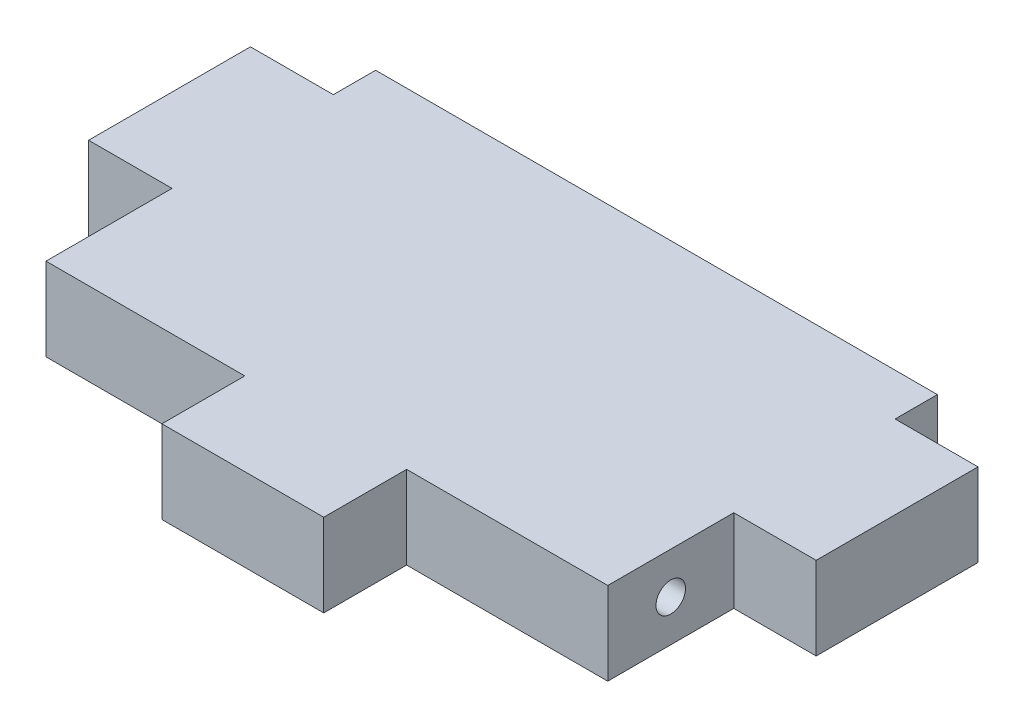
ISO-10303-21;
HEADER;
FILE_DESCRIPTION(('STEP AP214'),'2;1');
FILE_NAME('part.step','',(''),(''),'','','');
FILE_SCHEMA(('AUTOMOTIVE_DESIGN { 1 0 10303 214 1 1 1 1 }'));
ENDSEC;
DATA;
#1=APPLICATION_CONTEXT('core data for automotive mechanical design processes');
#2=APPLICATION_PROTOCOL_DEFINITION('international standard','automotive_design',2000,#1);
#3=PRODUCT_CONTEXT('',#1,'mechanical');
#4=PRODUCT('Part','Part','',(#3));
#5=PRODUCT_RELATED_PRODUCT_CATEGORY('part','',(#4));
#6=PRODUCT_DEFINITION_FORMATION('','',#4);
#7=PRODUCT_DEFINITION_CONTEXT('part definition',#1,'design');
#8=PRODUCT_DEFINITION('design','',#6,#7);
#9=PRODUCT_DEFINITION_SHAPE('','',#8);
#10=(LENGTH_UNIT() NAMED_UNIT(*) SI_UNIT(.MILLI.,.METRE.));
#11=(NAMED_UNIT(*) PLANE_ANGLE_UNIT() SI_UNIT($,.RADIAN.));
#12=(NAMED_UNIT(*) SI_UNIT($,.STERADIAN.) SOLID_ANGLE_UNIT());
#13=UNCERTAINTY_MEASURE_WITH_UNIT(LENGTH_MEASURE(1.E-05),#10,'distance_accuracy_value','');
#14=(GEOMETRIC_REPRESENTATION_CONTEXT(3) GLOBAL_UNCERTAINTY_ASSIGNED_CONTEXT((#13)) GLOBAL_UNIT_ASSIGNED_CONTEXT((#10,
#11,#12)) REPRESENTATION_CONTEXT('',''));
#15=CARTESIAN_POINT('',(0.,0.,0.));
#16=DIRECTION('',(0.,0.,1.));
#17=DIRECTION('',(1.,0.,0.));
#18=AXIS2_PLACEMENT_3D('',#15,#16,#17);
#19=CARTESIAN_POINT('',(-21.4249,6.35,15.912165879998));
#20=DIRECTION('',(1.,0.,0.));
#21=DIRECTION('',(0.,0.,-1.));
#22=AXIS2_PLACEMENT_3D('',#19,#20,#21);
#23=PLANE('',#22);
#24=DIRECTION('',(0.,0.,1.));
#25=VECTOR('',#24,1.);
#26=CARTESIAN_POINT('',(-21.4249,0.,15.912165879998));
#27=LINE('',#26,#25);
#28=CARTESIAN_POINT('',(-21.4249,0.,6.26016587999947));
#29=VERTEX_POINT('',#28);
#30=CARTESIAN_POINT('',(-21.4249,0.,15.912165879998));
#31=VERTEX_POINT('',#30);
#32=EDGE_CURVE('E178',#29,#31,#27,.T.);
#33=ORIENTED_EDGE('',*,*,#32,.T.);
#34=DIRECTION('',(0.,-1.,0.));
#35=VECTOR('',#34,1.);
#36=CARTESIAN_POINT('',(-21.4249,6.35,15.912165879998));
#37=LINE('',#36,#35);
#38=CARTESIAN_POINT('',(-21.4249,6.35,15.912165879998));
#39=VERTEX_POINT('',#38);
#40=EDGE_CURVE('E11',#39,#31,#37,.T.);
#41=ORIENTED_EDGE('',*,*,#40,.F.);
#42=DIRECTION('',(0.,0.,1.));
#43=VECTOR('',#42,1.);
#44=CARTESIAN_POINT('',(-21.4249,6.35,15.912165879998));
#45=LINE('',#44,#43);
#46=CARTESIAN_POINT('',(-21.4249,6.35,6.26016587999947));
#47=VERTEX_POINT('',#46);
#48=EDGE_CURVE('E209',#47,#39,#45,.T.);
#49=ORIENTED_EDGE('',*,*,#48,.F.);
#50=DIRECTION('',(0.,-1.,0.));
#51=VECTOR('',#50,1.);
#52=CARTESIAN_POINT('',(-21.4249,6.35,6.26016587999947));
#53=LINE('',#52,#51);
#54=EDGE_CURVE('E174',#47,#29,#53,.T.);
#55=ORIENTED_EDGE('',*,*,#54,.T.);
#56=EDGE_LOOP('',(#33,#41,#49,#55));
#57=FACE_BOUND('',#56,.T.);
#58=CARTESIAN_POINT('',(-21.4249,3.175,11.0861658799995));
#59=DIRECTION('',(1.,0.,0.));
#60=DIRECTION('',(0.,0.,-1.));
#61=AXIS2_PLACEMENT_3D('',#58,#59,#60);
#62=CIRCLE('',#61,1.1303);
#63=CARTESIAN_POINT('',(-21.4249,3.175,9.95586587999948));
#64=VERTEX_POINT('',#63);
#65=EDGE_CURVE('E36',#64,#64,#62,.F.);
#66=ORIENTED_EDGE('',*,*,#65,.F.);
#67=EDGE_LOOP('',(#66));
#68=FACE_BOUND('',#67,.T.);
#69=ADVANCED_FACE('F33',(#57,#68),#23,.F.);
#70=CARTESIAN_POINT('',(-21.4249,6.35,15.912165879998));
#71=DIRECTION('',(0.,0.,-1.));
#72=DIRECTION('',(-1.,0.,0.));
#73=AXIS2_PLACEMENT_3D('',#70,#71,#72);
#74=PLANE('',#73);
#75=DIRECTION('',(1.,0.,0.));
#76=VECTOR('',#75,1.);
#77=CARTESIAN_POINT('',(-21.4249,0.,15.912165879998));
#78=LINE('',#77,#76);
#79=CARTESIAN_POINT('',(-6.1976,0.,15.912165879998));
#80=VERTEX_POINT('',#79);
#81=EDGE_CURVE('E181',#31,#80,#78,.T.);
#82=ORIENTED_EDGE('',*,*,#81,.T.);
#83=DIRECTION('',(0.,-1.,0.));
#84=VECTOR('',#83,1.);
#85=CARTESIAN_POINT('',(-6.1976,6.35,15.912165879998));
#86=LINE('',#85,#84);
#87=CARTESIAN_POINT('',(-6.1976,6.35,15.912165879998));
#88=VERTEX_POINT('',#87);
#89=EDGE_CURVE('E42',#88,#80,#86,.T.);
#90=ORIENTED_EDGE('',*,*,#89,.F.);
#91=DIRECTION('',(1.,0.,0.));
#92=VECTOR('',#91,1.);
#93=CARTESIAN_POINT('',(-21.4249,6.35,15.912165879998));
#94=LINE('',#93,#92);
#95=EDGE_CURVE('E117',#39,#88,#94,.T.);
#96=ORIENTED_EDGE('',*,*,#95,.F.);
#97=ORIENTED_EDGE('',*,*,#40,.T.);
#98=EDGE_LOOP('',(#82,#90,#96,#97));
#99=FACE_BOUND('',#98,.T.);
#100=ADVANCED_FACE('F309',(#99),#74,.F.);
#101=CARTESIAN_POINT('',(-6.1976,6.35,22.262165879998));
#102=DIRECTION('',(1.,0.,0.));
#103=DIRECTION('',(0.,0.,-1.));
#104=AXIS2_PLACEMENT_3D('',#101,#102,#103);
#105=PLANE('',#104);
#106=DIRECTION('',(0.,0.,1.));
#107=VECTOR('',#106,1.);
#108=CARTESIAN_POINT('',(-6.1976,0.,22.262165879998));
#109=LINE('',#108,#107);
#110=CARTESIAN_POINT('',(-6.1976,0.,22.262165879998));
#111=VERTEX_POINT('',#110);
#112=EDGE_CURVE('E184',#80,#111,#109,.T.);
#113=ORIENTED_EDGE('',*,*,#112,.T.);
#114=DIRECTION('',(0.,-1.,0.));
#115=VECTOR('',#114,1.);
#116=CARTESIAN_POINT('',(-6.1976,6.35,22.262165879998));
#117=LINE('',#116,#115);
#118=CARTESIAN_POINT('',(-6.1976,6.35,22.262165879998));
#119=VERTEX_POINT('',#118);
#120=EDGE_CURVE('E240',#119,#111,#117,.T.);
#121=ORIENTED_EDGE('',*,*,#120,.F.);
#122=DIRECTION('',(0.,0.,1.));
#123=VECTOR('',#122,1.);
#124=CARTESIAN_POINT('',(-6.1976,6.35,22.262165879998));
#125=LINE('',#124,#123);
#126=EDGE_CURVE('E249',#88,#119,#125,.T.);
#127=ORIENTED_EDGE('',*,*,#126,.F.);
#128=ORIENTED_EDGE('',*,*,#89,.T.);
#129=EDGE_LOOP('',(#113,#121,#127,#128));
#130=FACE_BOUND('',#129,.T.);
#131=ADVANCED_FACE('F247',(#130),#105,.F.);
#132=CARTESIAN_POINT('',(6.1976,6.35,22.262165879998));
#133=DIRECTION('',(0.,0.,-1.));
#134=DIRECTION('',(-1.,0.,0.));
#135=AXIS2_PLACEMENT_3D('',#132,#133,#134);
#136=PLANE('',#135);
#137=DIRECTION('',(1.,0.,0.));
#138=VECTOR('',#137,1.);
#139=CARTESIAN_POINT('',(6.1976,0.,22.262165879998));
#140=LINE('',#139,#138);
#141=CARTESIAN_POINT('',(6.1976,0.,22.262165879998));
#142=VERTEX_POINT('',#141);
#143=EDGE_CURVE('E186',#111,#142,#140,.T.);
#144=ORIENTED_EDGE('',*,*,#143,.T.);
#145=DIRECTION('',(0.,-1.,0.));
#146=VECTOR('',#145,1.);
#147=CARTESIAN_POINT('',(6.1976,6.35,22.262165879998));
#148=LINE('',#147,#146);
#149=CARTESIAN_POINT('',(6.1976,6.35,22.262165879998));
#150=VERTEX_POINT('',#149);
#151=EDGE_CURVE('E237',#150,#142,#148,.T.);
#152=ORIENTED_EDGE('',*,*,#151,.F.);
#153=DIRECTION('',(1.,0.,0.));
#154=VECTOR('',#153,1.);
#155=CARTESIAN_POINT('',(6.1976,6.35,22.262165879998));
#156=LINE('',#155,#154);
#157=EDGE_CURVE('E267',#119,#150,#156,.T.);
#158=ORIENTED_EDGE('',*,*,#157,.F.);
#159=ORIENTED_EDGE('',*,*,#120,.T.);
#160=EDGE_LOOP('',(#144,#152,#158,#159));
#161=FACE_BOUND('',#160,.T.);
#162=ADVANCED_FACE('F258',(#161),#136,.F.);
#163=CARTESIAN_POINT('',(6.1976,6.35,15.912165879998));
#164=DIRECTION('',(-1.,0.,0.));
#165=DIRECTION('',(0.,0.,1.));
#166=AXIS2_PLACEMENT_3D('',#163,#164,#165);
#167=PLANE('',#166);
#168=DIRECTION('',(0.,0.,-1.));
#169=VECTOR('',#168,1.);
#170=CARTESIAN_POINT('',(6.1976,0.,15.912165879998));
#171=LINE('',#170,#169);
#172=CARTESIAN_POINT('',(6.1976,0.,15.912165879998));
#173=VERTEX_POINT('',#172);
#174=EDGE_CURVE('E188',#142,#173,#171,.T.);
#175=ORIENTED_EDGE('',*,*,#174,.T.);
#176=DIRECTION('',(0.,-1.,0.));
#177=VECTOR('',#176,1.);
#178=CARTESIAN_POINT('',(6.1976,6.35,15.912165879998));
#179=LINE('',#178,#177);
#180=CARTESIAN_POINT('',(6.1976,6.35,15.912165879998));
#181=VERTEX_POINT('',#180);
#182=EDGE_CURVE('E234',#181,#173,#179,.T.);
#183=ORIENTED_EDGE('',*,*,#182,.F.);
#184=DIRECTION('',(0.,0.,-1.));
#185=VECTOR('',#184,1.);
#186=CARTESIAN_POINT('',(6.1976,6.35,15.912165879998));
#187=LINE('',#186,#185);
#188=EDGE_CURVE('E264',#150,#181,#187,.T.);
#189=ORIENTED_EDGE('',*,*,#188,.F.);
#190=ORIENTED_EDGE('',*,*,#151,.T.);
#191=EDGE_LOOP('',(#175,#183,#189,#190));
#192=FACE_BOUND('',#191,.T.);
#193=ADVANCED_FACE('F262',(#192),#167,.F.);
#194=CARTESIAN_POINT('',(6.1976,6.35,15.912165879998));
#195=DIRECTION('',(0.,0.,-1.));
#196=DIRECTION('',(-1.,0.,0.));
#197=AXIS2_PLACEMENT_3D('',#194,#195,#196);
#198=PLANE('',#197);
#199=DIRECTION('',(1.,0.,0.));
#200=VECTOR('',#199,1.);
#201=CARTESIAN_POINT('',(6.1976,0.,15.912165879998));
#202=LINE('',#201,#200);
#203=CARTESIAN_POINT('',(21.6027000000022,0.,15.912165879998));
#204=VERTEX_POINT('',#203);
#205=EDGE_CURVE('E190',#173,#204,#202,.T.);
#206=ORIENTED_EDGE('',*,*,#205,.T.);
#207=DIRECTION('',(0.,-1.,0.));
#208=VECTOR('',#207,1.);
#209=CARTESIAN_POINT('',(21.6027000000022,6.35,15.912165879998));
#210=LINE('',#209,#208);
#211=CARTESIAN_POINT('',(21.6027000000022,6.35,15.912165879998));
#212=VERTEX_POINT('',#211);
#213=EDGE_CURVE('E231',#212,#204,#210,.T.);
#214=ORIENTED_EDGE('',*,*,#213,.F.);
#215=DIRECTION('',(1.,0.,0.));
#216=VECTOR('',#215,1.);
#217=CARTESIAN_POINT('',(6.1976,6.35,15.912165879998));
#218=LINE('',#217,#216);
#219=EDGE_CURVE('E266',#181,#212,#218,.T.);
#220=ORIENTED_EDGE('',*,*,#219,.F.);
#221=ORIENTED_EDGE('',*,*,#182,.T.);
#222=EDGE_LOOP('',(#206,#214,#220,#221));
#223=FACE_BOUND('',#222,.T.);
#224=ADVANCED_FACE('F322',(#223),#198,.F.);
#225=CARTESIAN_POINT('',(21.6027000000022,6.35,6.26016587999947));
#226=DIRECTION('',(-1.,0.,0.));
#227=DIRECTION('',(0.,0.,1.));
#228=AXIS2_PLACEMENT_3D('',#225,#226,#227);
#229=PLANE('',#228);
#230=CARTESIAN_POINT('',(21.6027000000022,3.175,11.0861658799995));
#231=DIRECTION('',(1.,0.,0.));
#232=DIRECTION('',(0.,0.,-1.));
#233=AXIS2_PLACEMENT_3D('',#230,#231,#232);
#234=CIRCLE('',#233,1.1303);
#235=CARTESIAN_POINT('',(21.6027000000022,3.175,9.95586587999948));
#236=VERTEX_POINT('',#235);
#237=EDGE_CURVE('E437',#236,#236,#234,.T.);
#238=ORIENTED_EDGE('',*,*,#237,.F.);
#239=EDGE_LOOP('',(#238));
#240=FACE_BOUND('',#239,.T.);
#241=DIRECTION('',(0.,0.,-1.));
#242=VECTOR('',#241,1.);
#243=CARTESIAN_POINT('',(21.6027000000022,0.,6.26016587999947));
#244=LINE('',#243,#242);
#245=CARTESIAN_POINT('',(21.6027000000022,0.,6.26016587999947));
#246=VERTEX_POINT('',#245);
#247=EDGE_CURVE('E192',#204,#246,#244,.T.);
#248=ORIENTED_EDGE('',*,*,#247,.T.);
#249=DIRECTION('',(0.,-1.,0.));
#250=VECTOR('',#249,1.);
#251=CARTESIAN_POINT('',(21.6027000000022,6.35,6.26016587999947));
#252=LINE('',#251,#250);
#253=CARTESIAN_POINT('',(21.6027000000022,6.35,6.26016587999947));
#254=VERTEX_POINT('',#253);
#255=EDGE_CURVE('E228',#254,#246,#252,.T.);
#256=ORIENTED_EDGE('',*,*,#255,.F.);
#257=DIRECTION('',(0.,0.,-1.));
#258=VECTOR('',#257,1.);
#259=CARTESIAN_POINT('',(21.6027000000022,6.35,6.26016587999947));
#260=LINE('',#259,#258);
#261=EDGE_CURVE('E269',#212,#254,#260,.T.);
#262=ORIENTED_EDGE('',*,*,#261,.F.);
#263=ORIENTED_EDGE('',*,*,#213,.T.);
#264=EDGE_LOOP('',(#248,#256,#262,#263));
#265=FACE_BOUND('',#264,.T.);
#266=ADVANCED_FACE('F325',(#240,#265),#229,.F.);
#267=CARTESIAN_POINT('',(21.6027000000022,6.35,6.26016587999947));
#268=DIRECTION('',(0.,0.,-1.));
#269=DIRECTION('',(-1.,0.,0.));
#270=AXIS2_PLACEMENT_3D('',#267,#268,#269);
#271=PLANE('',#270);
#272=DIRECTION('',(1.,0.,0.));
#273=VECTOR('',#272,1.);
#274=CARTESIAN_POINT('',(21.6027000000022,0.,6.26016587999947));
#275=LINE('',#274,#273);
#276=CARTESIAN_POINT('',(27.9141672005753,0.,6.26016587999947));
#277=VERTEX_POINT('',#276);
#278=EDGE_CURVE('E194',#246,#277,#275,.T.);
#279=ORIENTED_EDGE('',*,*,#278,.T.);
#280=DIRECTION('',(0.,-1.,0.));
#281=VECTOR('',#280,1.);
#282=CARTESIAN_POINT('',(27.9141672005753,6.35,6.26016587999947));
#283=LINE('',#282,#281);
#284=CARTESIAN_POINT('',(27.9141672005753,6.35,6.26016587999947));
#285=VERTEX_POINT('',#284);
#286=EDGE_CURVE('E225',#285,#277,#283,.T.);
#287=ORIENTED_EDGE('',*,*,#286,.F.);
#288=DIRECTION('',(1.,0.,0.));
#289=VECTOR('',#288,1.);
#290=CARTESIAN_POINT('',(21.6027000000022,6.35,6.26016587999947));
#291=LINE('',#290,#289);
#292=EDGE_CURVE('E275',#254,#285,#291,.T.);
#293=ORIENTED_EDGE('',*,*,#292,.F.);
#294=ORIENTED_EDGE('',*,*,#255,.T.);
#295=EDGE_LOOP('',(#279,#287,#293,#294));
#296=FACE_BOUND('',#295,.T.);
#297=ADVANCED_FACE('F329',(#296),#271,.F.);
#298=CARTESIAN_POINT('',(27.9141672005753,6.35,-6.13503412000053));
#299=DIRECTION('',(-1.,0.,0.));
#300=DIRECTION('',(0.,0.,1.));
#301=AXIS2_PLACEMENT_3D('',#298,#299,#300);
#302=PLANE('',#301);
#303=DIRECTION('',(0.,0.,-1.));
#304=VECTOR('',#303,1.);
#305=CARTESIAN_POINT('',(27.9141672005753,0.,-6.13503412000053));
#306=LINE('',#305,#304);
#307=CARTESIAN_POINT('',(27.9141672005753,0.,-6.13503412000053));
#308=VERTEX_POINT('',#307);
#309=EDGE_CURVE('E196',#277,#308,#306,.T.);
#310=ORIENTED_EDGE('',*,*,#309,.T.);
#311=DIRECTION('',(0.,-1.,0.));
#312=VECTOR('',#311,1.);
#313=CARTESIAN_POINT('',(27.9141672005753,6.35,-6.13503412000053));
#314=LINE('',#313,#312);
#315=CARTESIAN_POINT('',(27.9141672005753,6.35,-6.13503412000053));
#316=VERTEX_POINT('',#315);
#317=EDGE_CURVE('E222',#316,#308,#314,.T.);
#318=ORIENTED_EDGE('',*,*,#317,.F.);
#319=DIRECTION('',(0.,0.,-1.));
#320=VECTOR('',#319,1.);
#321=CARTESIAN_POINT('',(27.9141672005753,6.35,-6.13503412000053));
#322=LINE('',#321,#320);
#323=EDGE_CURVE('E277',#285,#316,#322,.T.);
#324=ORIENTED_EDGE('',*,*,#323,.F.);
#325=ORIENTED_EDGE('',*,*,#286,.T.);
#326=EDGE_LOOP('',(#310,#318,#324,#325));
#327=FACE_BOUND('',#326,.T.);
#328=ADVANCED_FACE('F333',(#327),#302,.F.);
#329=CARTESIAN_POINT('',(21.5641672005753,6.35,-6.13503412000053));
#330=DIRECTION('',(0.,0.,1.));
#331=DIRECTION('',(1.,0.,0.));
#332=AXIS2_PLACEMENT_3D('',#329,#330,#331);
#333=PLANE('',#332);
#334=DIRECTION('',(-1.,0.,0.));
#335=VECTOR('',#334,1.);
#336=CARTESIAN_POINT('',(21.5641672005753,0.,-6.13503412000053));
#337=LINE('',#336,#335);
#338=CARTESIAN_POINT('',(21.5641672005753,0.,-6.13503412000053));
#339=VERTEX_POINT('',#338);
#340=EDGE_CURVE('E198',#308,#339,#337,.T.);
#341=ORIENTED_EDGE('',*,*,#340,.T.);
#342=DIRECTION('',(0.,-1.,0.));
#343=VECTOR('',#342,1.);
#344=CARTESIAN_POINT('',(21.5641672005753,6.35,-6.13503412000053));
#345=LINE('',#344,#343);
#346=CARTESIAN_POINT('',(21.5641672005753,6.35,-6.13503412000053));
#347=VERTEX_POINT('',#346);
#348=EDGE_CURVE('E219',#347,#339,#345,.T.);
#349=ORIENTED_EDGE('',*,*,#348,.F.);
#350=DIRECTION('',(-1.,0.,0.));
#351=VECTOR('',#350,1.);
#352=CARTESIAN_POINT('',(21.5641672005753,6.35,-6.13503412000053));
#353=LINE('',#352,#351);
#354=EDGE_CURVE('E279',#316,#347,#353,.T.);
#355=ORIENTED_EDGE('',*,*,#354,.F.);
#356=ORIENTED_EDGE('',*,*,#317,.T.);
#357=EDGE_LOOP('',(#341,#349,#355,#356));
#358=FACE_BOUND('',#357,.T.);
#359=ADVANCED_FACE('F337',(#358),#333,.F.);
#360=CARTESIAN_POINT('',(21.5641672005753,6.35,-9.37353411999797));
#361=DIRECTION('',(-1.,0.,0.));
#362=DIRECTION('',(0.,0.,1.));
#363=AXIS2_PLACEMENT_3D('',#360,#361,#362);
#364=PLANE('',#363);
#365=DIRECTION('',(0.,0.,-1.));
#366=VECTOR('',#365,1.);
#367=CARTESIAN_POINT('',(21.5641672005753,0.,-9.37353411999797));
#368=LINE('',#367,#366);
#369=CARTESIAN_POINT('',(21.5641672005753,0.,-9.37353411999797));
#370=VERTEX_POINT('',#369);
#371=EDGE_CURVE('E200',#339,#370,#368,.T.);
#372=ORIENTED_EDGE('',*,*,#371,.T.);
#373=DIRECTION('',(0.,-1.,0.));
#374=VECTOR('',#373,1.);
#375=CARTESIAN_POINT('',(21.5641672005753,6.35,-9.37353411999797));
#376=LINE('',#375,#374);
#377=CARTESIAN_POINT('',(21.5641672005753,6.35,-9.37353411999797));
#378=VERTEX_POINT('',#377);
#379=EDGE_CURVE('E216',#378,#370,#376,.T.);
#380=ORIENTED_EDGE('',*,*,#379,.F.);
#381=DIRECTION('',(0.,0.,-1.));
#382=VECTOR('',#381,1.);
#383=CARTESIAN_POINT('',(21.5641672005753,6.35,-9.37353411999797));
#384=LINE('',#383,#382);
#385=EDGE_CURVE('E281',#347,#378,#384,.T.);
#386=ORIENTED_EDGE('',*,*,#385,.F.);
#387=ORIENTED_EDGE('',*,*,#348,.T.);
#388=EDGE_LOOP('',(#372,#380,#386,#387));
#389=FACE_BOUND('',#388,.T.);
#390=ADVANCED_FACE('F341',(#389),#364,.F.);
#391=CARTESIAN_POINT('',(21.5641672005753,6.35,-9.37353411999797));
#392=DIRECTION('',(0.,0.,1.));
#393=DIRECTION('',(1.,0.,0.));
#394=AXIS2_PLACEMENT_3D('',#391,#392,#393);
#395=PLANE('',#394);
#396=DIRECTION('',(-1.,0.,0.));
#397=VECTOR('',#396,1.);
#398=CARTESIAN_POINT('',(21.5641672005753,0.,-9.37353411999797));
#399=LINE('',#398,#397);
#400=CARTESIAN_POINT('',(-21.4634327994247,0.,-9.37353411999796));
#401=VERTEX_POINT('',#400);
#402=EDGE_CURVE('E202',#370,#401,#399,.T.);
#403=ORIENTED_EDGE('',*,*,#402,.T.);
#404=DIRECTION('',(0.,-1.,0.));
#405=VECTOR('',#404,1.);
#406=CARTESIAN_POINT('',(-21.4634327994247,6.35,-9.37353411999796));
#407=LINE('',#406,#405);
#408=CARTESIAN_POINT('',(-21.4634327994247,6.35,-9.37353411999796));
#409=VERTEX_POINT('',#408);
#410=EDGE_CURVE('E213',#409,#401,#407,.T.);
#411=ORIENTED_EDGE('',*,*,#410,.F.);
#412=DIRECTION('',(-1.,0.,0.));
#413=VECTOR('',#412,1.);
#414=CARTESIAN_POINT('',(21.5641672005753,6.35,-9.37353411999797));
#415=LINE('',#414,#413);
#416=EDGE_CURVE('E283',#378,#409,#415,.T.);
#417=ORIENTED_EDGE('',*,*,#416,.F.);
#418=ORIENTED_EDGE('',*,*,#379,.T.);
#419=EDGE_LOOP('',(#403,#411,#417,#418));
#420=FACE_BOUND('',#419,.T.);
#421=ADVANCED_FACE('F289',(#420),#395,.F.);
#422=CARTESIAN_POINT('',(-21.4634327994247,6.35,-9.37353411999796));
#423=DIRECTION('',(1.,0.,0.));
#424=DIRECTION('',(0.,0.,-1.));
#425=AXIS2_PLACEMENT_3D('',#422,#423,#424);
#426=PLANE('',#425);
#427=DIRECTION('',(0.,0.,1.));
#428=VECTOR('',#427,1.);
#429=CARTESIAN_POINT('',(-21.4634327994247,0.,-9.37353411999796));
#430=LINE('',#429,#428);
#431=CARTESIAN_POINT('',(-21.4634327994247,0.,-6.13503412000053));
#432=VERTEX_POINT('',#431);
#433=EDGE_CURVE('E204',#401,#432,#430,.T.);
#434=ORIENTED_EDGE('',*,*,#433,.T.);
#435=DIRECTION('',(0.,-1.,0.));
#436=VECTOR('',#435,1.);
#437=CARTESIAN_POINT('',(-21.4634327994247,6.35,-6.13503412000053));
#438=LINE('',#437,#436);
#439=CARTESIAN_POINT('',(-21.4634327994247,6.35,-6.13503412000053));
#440=VERTEX_POINT('',#439);
#441=EDGE_CURVE('E169',#440,#432,#438,.T.);
#442=ORIENTED_EDGE('',*,*,#441,.F.);
#443=DIRECTION('',(0.,0.,1.));
#444=VECTOR('',#443,1.);
#445=CARTESIAN_POINT('',(-21.4634327994247,6.35,-9.37353411999796));
#446=LINE('',#445,#444);
#447=EDGE_CURVE('E160',#409,#440,#446,.T.);
#448=ORIENTED_EDGE('',*,*,#447,.F.);
#449=ORIENTED_EDGE('',*,*,#410,.T.);
#450=EDGE_LOOP('',(#434,#442,#448,#449));
#451=FACE_BOUND('',#450,.T.);
#452=ADVANCED_FACE('F293',(#451),#426,.F.);
#453=CARTESIAN_POINT('',(-21.4634327994247,6.35,-6.13503412000053));
#454=DIRECTION('',(0.,0.,1.));
#455=DIRECTION('',(1.,0.,0.));
#456=AXIS2_PLACEMENT_3D('',#453,#454,#455);
#457=PLANE('',#456);
#458=DIRECTION('',(-1.,0.,0.));
#459=VECTOR('',#458,1.);
#460=CARTESIAN_POINT('',(-21.4634327994247,0.,-6.13503412000053));
#461=LINE('',#460,#459);
#462=CARTESIAN_POINT('',(-27.8134327994247,0.,-6.13503412000053));
#463=VERTEX_POINT('',#462);
#464=EDGE_CURVE('E168',#432,#463,#461,.T.);
#465=ORIENTED_EDGE('',*,*,#464,.T.);
#466=DIRECTION('',(0.,-1.,0.));
#467=VECTOR('',#466,1.);
#468=CARTESIAN_POINT('',(-27.8134327994247,6.35,-6.13503412000053));
#469=LINE('',#468,#467);
#470=CARTESIAN_POINT('',(-27.8134327994247,6.35,-6.13503412000053));
#471=VERTEX_POINT('',#470);
#472=EDGE_CURVE('E165',#471,#463,#469,.T.);
#473=ORIENTED_EDGE('',*,*,#472,.F.);
#474=DIRECTION('',(-1.,0.,0.));
#475=VECTOR('',#474,1.);
#476=CARTESIAN_POINT('',(-21.4634327994247,6.35,-6.13503412000053));
#477=LINE('',#476,#475);
#478=EDGE_CURVE('E154',#440,#471,#477,.T.);
#479=ORIENTED_EDGE('',*,*,#478,.F.);
#480=ORIENTED_EDGE('',*,*,#441,.T.);
#481=EDGE_LOOP('',(#465,#473,#479,#480));
#482=FACE_BOUND('',#481,.T.);
#483=ADVANCED_FACE('F166',(#482),#457,.F.);
#484=CARTESIAN_POINT('',(-27.8134327994247,6.35,-6.13503412000053));
#485=DIRECTION('',(1.,0.,0.));
#486=DIRECTION('',(0.,0.,-1.));
#487=AXIS2_PLACEMENT_3D('',#484,#485,#486);
#488=PLANE('',#487);
#489=DIRECTION('',(0.,0.,1.));
#490=VECTOR('',#489,1.);
#491=CARTESIAN_POINT('',(-27.8134327994247,0.,-6.13503412000053));
#492=LINE('',#491,#490);
#493=CARTESIAN_POINT('',(-27.8134327994247,0.,6.26016587999947));
#494=VERTEX_POINT('',#493);
#495=EDGE_CURVE('E103',#463,#494,#492,.T.);
#496=ORIENTED_EDGE('',*,*,#495,.T.);
#497=DIRECTION('',(0.,-1.,0.));
#498=VECTOR('',#497,1.);
#499=CARTESIAN_POINT('',(-27.8134327994247,6.35,6.26016587999947));
#500=LINE('',#499,#498);
#501=CARTESIAN_POINT('',(-27.8134327994247,6.35,6.26016587999947));
#502=VERTEX_POINT('',#501);
#503=EDGE_CURVE('E170',#502,#494,#500,.T.);
#504=ORIENTED_EDGE('',*,*,#503,.F.);
#505=DIRECTION('',(0.,0.,1.));
#506=VECTOR('',#505,1.);
#507=CARTESIAN_POINT('',(-27.8134327994247,6.35,-6.13503412000053));
#508=LINE('',#507,#506);
#509=EDGE_CURVE('E158',#471,#502,#508,.T.);
#510=ORIENTED_EDGE('',*,*,#509,.F.);
#511=ORIENTED_EDGE('',*,*,#472,.T.);
#512=EDGE_LOOP('',(#496,#504,#510,#511));
#513=FACE_BOUND('',#512,.T.);
#514=ADVANCED_FACE('F172',(#513),#488,.F.);
#515=CARTESIAN_POINT('',(-21.4249,6.35,6.26016587999947));
#516=DIRECTION('',(0.,0.,-1.));
#517=DIRECTION('',(-1.,0.,0.));
#518=AXIS2_PLACEMENT_3D('',#515,#516,#517);
#519=PLANE('',#518);
#520=DIRECTION('',(1.,0.,0.));
#521=VECTOR('',#520,1.);
#522=CARTESIAN_POINT('',(-21.4249,0.,6.26016587999947));
#523=LINE('',#522,#521);
#524=EDGE_CURVE('E109',#494,#29,#523,.T.);
#525=ORIENTED_EDGE('',*,*,#524,.T.);
#526=ORIENTED_EDGE('',*,*,#54,.F.);
#527=DIRECTION('',(1.,0.,0.));
#528=VECTOR('',#527,1.);
#529=CARTESIAN_POINT('',(-21.4249,6.35,6.26016587999947));
#530=LINE('',#529,#528);
#531=EDGE_CURVE('E50',#502,#47,#530,.T.);
#532=ORIENTED_EDGE('',*,*,#531,.F.);
#533=ORIENTED_EDGE('',*,*,#503,.T.);
#534=EDGE_LOOP('',(#525,#526,#532,#533));
#535=FACE_BOUND('',#534,.T.);
#536=ADVANCED_FACE('F298',(#535),#519,.F.);
#537=CARTESIAN_POINT('',(-21.4249,6.35,6.26016587999947));
#538=DIRECTION('',(0.,1.,0.));
#539=DIRECTION('',(0.,0.,1.));
#540=AXIS2_PLACEMENT_3D('',#537,#538,#539);
#541=PLANE('',#540);
#542=ORIENTED_EDGE('',*,*,#48,.T.);
#543=ORIENTED_EDGE('',*,*,#95,.T.);
#544=ORIENTED_EDGE('',*,*,#126,.T.);
#545=ORIENTED_EDGE('',*,*,#157,.T.);
#546=ORIENTED_EDGE('',*,*,#188,.T.);
#547=ORIENTED_EDGE('',*,*,#219,.T.);
#548=ORIENTED_EDGE('',*,*,#261,.T.);
#549=ORIENTED_EDGE('',*,*,#292,.T.);
#550=ORIENTED_EDGE('',*,*,#323,.T.);
#551=ORIENTED_EDGE('',*,*,#354,.T.);
#552=ORIENTED_EDGE('',*,*,#385,.T.);
#553=ORIENTED_EDGE('',*,*,#416,.T.);
#554=ORIENTED_EDGE('',*,*,#447,.T.);
#555=ORIENTED_EDGE('',*,*,#478,.T.);
#556=ORIENTED_EDGE('',*,*,#509,.T.);
#557=ORIENTED_EDGE('',*,*,#531,.T.);
#558=EDGE_LOOP('',(#542,#543,#544,#545,#546,#547,#548,#549,#550,#551,#552,#553,#554,#555,#556,#557));
#559=FACE_BOUND('',#558,.T.);
#560=ADVANCED_FACE('F156',(#559),#541,.T.);
#561=CARTESIAN_POINT('',(-21.4249,0.,6.26016587999947));
#562=DIRECTION('',(0.,1.,0.));
#563=DIRECTION('',(0.,0.,1.));
#564=AXIS2_PLACEMENT_3D('',#561,#562,#563);
#565=PLANE('',#564);
#566=ORIENTED_EDGE('',*,*,#32,.F.);
#567=ORIENTED_EDGE('',*,*,#524,.F.);
#568=ORIENTED_EDGE('',*,*,#495,.F.);
#569=ORIENTED_EDGE('',*,*,#464,.F.);
#570=ORIENTED_EDGE('',*,*,#433,.F.);
#571=ORIENTED_EDGE('',*,*,#402,.F.);
#572=ORIENTED_EDGE('',*,*,#371,.F.);
#573=ORIENTED_EDGE('',*,*,#340,.F.);
#574=ORIENTED_EDGE('',*,*,#309,.F.);
#575=ORIENTED_EDGE('',*,*,#278,.F.);
#576=ORIENTED_EDGE('',*,*,#247,.F.);
#577=ORIENTED_EDGE('',*,*,#205,.F.);
#578=ORIENTED_EDGE('',*,*,#174,.F.);
#579=ORIENTED_EDGE('',*,*,#143,.F.);
#580=ORIENTED_EDGE('',*,*,#112,.F.);
#581=ORIENTED_EDGE('',*,*,#81,.F.);
#582=EDGE_LOOP('',(#566,#567,#568,#569,#570,#571,#572,#573,#574,#575,#576,#577,#578,#579,#580,#581));
#583=FACE_BOUND('',#582,.T.);
#584=ADVANCED_FACE('F253',(#583),#565,.F.);
#585=CARTESIAN_POINT('',(8.90270000000216,3.175,11.0861658799995));
#586=DIRECTION('',(1.,0.,0.));
#587=DIRECTION('',(0.,0.,-1.));
#588=AXIS2_PLACEMENT_3D('',#585,#586,#587);
#589=CYLINDRICAL_SURFACE('',#588,1.1303);
#590=CARTESIAN_POINT('',(8.90270000000216,3.175,11.0861658799995));
#591=DIRECTION('',(1.,0.,0.));
#592=DIRECTION('',(0.,0.,-1.));
#593=AXIS2_PLACEMENT_3D('',#590,#591,#592);
#594=CIRCLE('',#593,1.1303);
#595=CARTESIAN_POINT('',(8.90270000000216,3.175,9.95586587999948));
#596=VERTEX_POINT('',#595);
#597=EDGE_CURVE('E182',#596,#596,#594,.T.);
#598=ORIENTED_EDGE('',*,*,#597,.F.);
#599=EDGE_LOOP('',(#598));
#600=FACE_BOUND('',#599,.T.);
#601=ORIENTED_EDGE('',*,*,#237,.T.);
#602=EDGE_LOOP('',(#601));
#603=FACE_BOUND('',#602,.T.);
#604=ADVANCED_FACE('F378',(#600,#603),#589,.F.);
#605=CARTESIAN_POINT('',(8.90270000000216,3.175,11.0861658799995));
#606=DIRECTION('',(1.,0.,0.));
#607=DIRECTION('',(0.,0.,-1.));
#608=AXIS2_PLACEMENT_3D('',#605,#606,#607);
#609=PLANE('',#608);
#610=ORIENTED_EDGE('',*,*,#597,.T.);
#611=EDGE_LOOP('',(#610));
#612=FACE_BOUND('',#611,.T.);
#613=ADVANCED_FACE('F394',(#612),#609,.T.);
#614=CARTESIAN_POINT('',(-8.90270000000216,3.175,11.0861658799995));
#615=DIRECTION('',(-1.,0.,0.));
#616=DIRECTION('',(0.,0.,1.));
#617=AXIS2_PLACEMENT_3D('',#614,#615,#616);
#618=CYLINDRICAL_SURFACE('',#617,1.1303);
#619=CARTESIAN_POINT('',(-8.90270000000216,3.175,11.0861658799995));
#620=DIRECTION('',(1.,0.,0.));
#621=DIRECTION('',(0.,0.,-1.));
#622=AXIS2_PLACEMENT_3D('',#619,#620,#621);
#623=CIRCLE('',#622,1.1303);
#624=CARTESIAN_POINT('',(-8.90270000000216,3.175,9.95586587999948));
#625=VERTEX_POINT('',#624);
#626=EDGE_CURVE('E434',#625,#625,#623,.T.);
#627=ORIENTED_EDGE('',*,*,#626,.T.);
#628=EDGE_LOOP('',(#627));
#629=FACE_BOUND('',#628,.T.);
#630=ORIENTED_EDGE('',*,*,#65,.T.);
#631=EDGE_LOOP('',(#630));
#632=FACE_BOUND('',#631,.T.);
#633=ADVANCED_FACE('F403',(#629,#632),#618,.F.);
#634=CARTESIAN_POINT('',(-8.90270000000216,3.175,11.0861658799995));
#635=DIRECTION('',(-1.,0.,0.));
#636=DIRECTION('',(0.,0.,-1.));
#637=AXIS2_PLACEMENT_3D('',#634,#635,#636);
#638=PLANE('',#637);
#639=ORIENTED_EDGE('',*,*,#626,.F.);
#640=EDGE_LOOP('',(#639));
#641=FACE_BOUND('',#640,.T.);
#642=ADVANCED_FACE('F418',(#641),#638,.T.);
#643=CLOSED_SHELL('',(#69,#100,#131,#162,#193,#224,#266,#297,#328,#359,#390,#421,#452,#483,#514,
#536,#560,#584,#604,#613,#633,#642));
#644=MANIFOLD_SOLID_BREP('B2',#643);
#645=ADVANCED_BREP_SHAPE_REPRESENTATION('',(#18,#644),#14);
#646=SHAPE_DEFINITION_REPRESENTATION(#9,#645);
ENDSEC;
END-ISO-10303-21;
